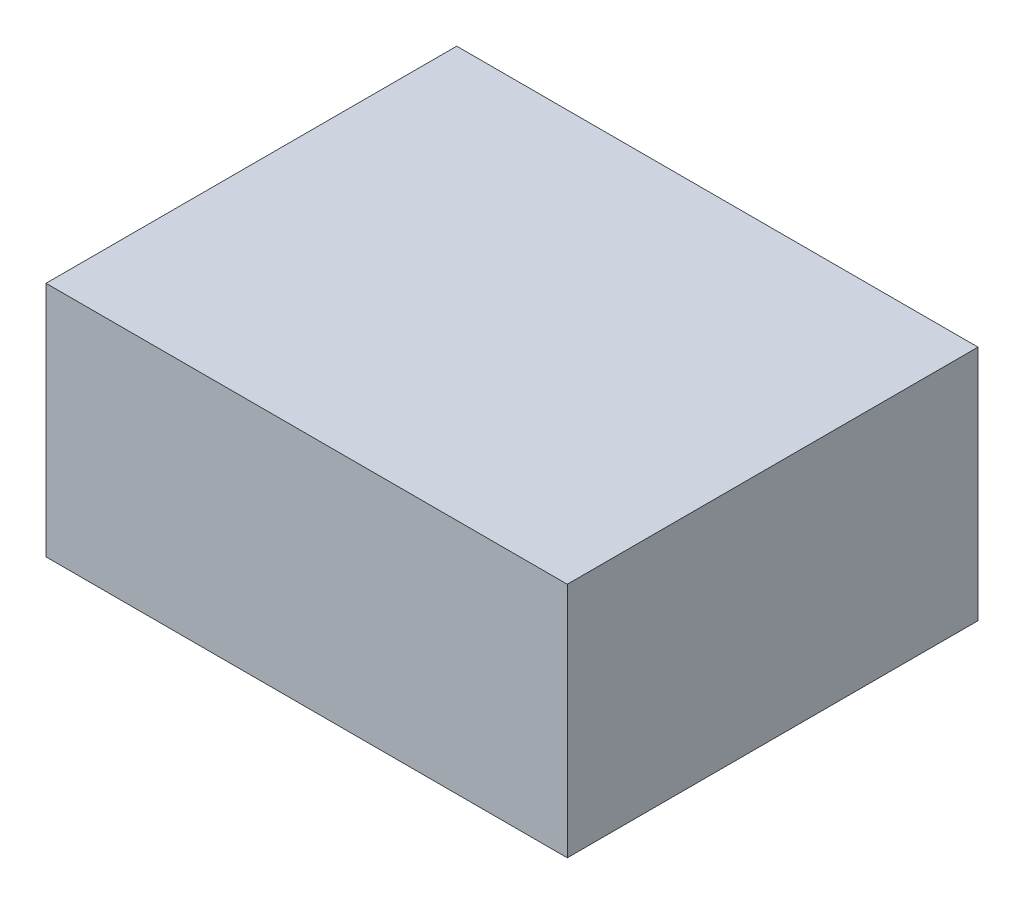
ISO-10303-21;
HEADER;
FILE_DESCRIPTION(('STEP AP214'),'2;1');
FILE_NAME('part.step','',(''),(''),'','','');
FILE_SCHEMA(('AUTOMOTIVE_DESIGN { 1 0 10303 214 1 1 1 1 }'));
ENDSEC;
DATA;
#1=APPLICATION_CONTEXT('core data for automotive mechanical design processes');
#2=APPLICATION_PROTOCOL_DEFINITION('international standard','automotive_design',2000,#1);
#3=PRODUCT_CONTEXT('',#1,'mechanical');
#4=PRODUCT('Part','Part','',(#3));
#5=PRODUCT_RELATED_PRODUCT_CATEGORY('part','',(#4));
#6=PRODUCT_DEFINITION_FORMATION('','',#4);
#7=PRODUCT_DEFINITION_CONTEXT('part definition',#1,'design');
#8=PRODUCT_DEFINITION('design','',#6,#7);
#9=PRODUCT_DEFINITION_SHAPE('','',#8);
#10=(LENGTH_UNIT() NAMED_UNIT(*) SI_UNIT(.MILLI.,.METRE.));
#11=(NAMED_UNIT(*) PLANE_ANGLE_UNIT() SI_UNIT($,.RADIAN.));
#12=(NAMED_UNIT(*) SI_UNIT($,.STERADIAN.) SOLID_ANGLE_UNIT());
#13=UNCERTAINTY_MEASURE_WITH_UNIT(LENGTH_MEASURE(1.E-05),#10,'distance_accuracy_value','');
#14=(GEOMETRIC_REPRESENTATION_CONTEXT(3) GLOBAL_UNCERTAINTY_ASSIGNED_CONTEXT((#13)) GLOBAL_UNIT_ASSIGNED_CONTEXT((#10,
#11,#12)) REPRESENTATION_CONTEXT('',''));
#15=CARTESIAN_POINT('',(0.,0.,0.));
#16=DIRECTION('',(0.,0.,1.));
#17=DIRECTION('',(1.,0.,0.));
#18=AXIS2_PLACEMENT_3D('',#15,#16,#17);
#19=CARTESIAN_POINT('',(-0.16499586,-0.07499857999998,0.));
#20=DIRECTION('',(0.,1.,0.));
#21=DIRECTION('',(1.,0.,0.));
#22=AXIS2_PLACEMENT_3D('',#19,#20,#21);
#23=PLANE('',#22);
#24=DIRECTION('',(1.,0.,0.));
#25=VECTOR('',#24,1.);
#26=CARTESIAN_POINT('',(-0.16499586,-0.07499857999998,0.));
#27=LINE('',#26,#25);
#28=CARTESIAN_POINT('',(-0.16499586,-0.07499857999998,0.));
#29=VERTEX_POINT('',#28);
#30=CARTESIAN_POINT('',(0.1649984,-0.07499857999998,0.));
#31=VERTEX_POINT('',#30);
#32=EDGE_CURVE('E11',#29,#31,#27,.T.);
#33=ORIENTED_EDGE('',*,*,#32,.T.);
#34=DIRECTION('',(0.,0.,1.));
#35=VECTOR('',#34,1.);
#36=CARTESIAN_POINT('',(0.1649984,-0.07499857999998,0.));
#37=LINE('',#36,#35);
#38=CARTESIAN_POINT('',(0.1649984,-0.07499857999998,0.25999948));
#39=VERTEX_POINT('',#38);
#40=EDGE_CURVE('E24',#31,#39,#37,.T.);
#41=ORIENTED_EDGE('',*,*,#40,.T.);
#42=DIRECTION('',(1.,0.,0.));
#43=VECTOR('',#42,1.);
#44=CARTESIAN_POINT('',(-0.16499586,-0.07499857999998,0.25999948));
#45=LINE('',#44,#43);
#46=CARTESIAN_POINT('',(-0.16499586,-0.07499857999998,0.25999948));
#47=VERTEX_POINT('',#46);
#48=EDGE_CURVE('E87',#47,#39,#45,.T.);
#49=ORIENTED_EDGE('',*,*,#48,.F.);
#50=DIRECTION('',(0.,0.,1.));
#51=VECTOR('',#50,1.);
#52=CARTESIAN_POINT('',(-0.16499586,-0.07499857999998,0.));
#53=LINE('',#52,#51);
#54=EDGE_CURVE('E36',#29,#47,#53,.T.);
#55=ORIENTED_EDGE('',*,*,#54,.F.);
#56=EDGE_LOOP('',(#33,#41,#49,#55));
#57=FACE_BOUND('',#56,.T.);
#58=ADVANCED_FACE('F17',(#57),#23,.F.);
#59=CARTESIAN_POINT('',(0.1649984,-0.07499857999998,0.));
#60=DIRECTION('',(-0.999999999856631,1.69333673670937E-05,0.));
#61=DIRECTION('',(1.69333673670937E-05,0.999999999856631,0.));
#62=AXIS2_PLACEMENT_3D('',#59,#60,#61);
#63=PLANE('',#62);
#64=DIRECTION('',(1.69333673670937E-05,0.999999999856631,0.));
#65=VECTOR('',#64,1.);
#66=CARTESIAN_POINT('',(0.1649984,-0.07499857999998,0.));
#67=LINE('',#66,#65);
#68=CARTESIAN_POINT('',(0.16500094,0.07500112000001,0.));
#69=VERTEX_POINT('',#68);
#70=EDGE_CURVE('E84',#31,#69,#67,.T.);
#71=ORIENTED_EDGE('',*,*,#70,.T.);
#72=DIRECTION('',(0.,0.,1.));
#73=VECTOR('',#72,1.);
#74=CARTESIAN_POINT('',(0.16500094,0.07500112000001,0.));
#75=LINE('',#74,#73);
#76=CARTESIAN_POINT('',(0.16500094,0.07500112000001,0.25999948));
#77=VERTEX_POINT('',#76);
#78=EDGE_CURVE('E82',#69,#77,#75,.T.);
#79=ORIENTED_EDGE('',*,*,#78,.T.);
#80=DIRECTION('',(1.69333673670937E-05,0.999999999856631,0.));
#81=VECTOR('',#80,1.);
#82=CARTESIAN_POINT('',(0.1649984,-0.07499857999998,0.25999948));
#83=LINE('',#82,#81);
#84=EDGE_CURVE('E62',#39,#77,#83,.T.);
#85=ORIENTED_EDGE('',*,*,#84,.F.);
#86=ORIENTED_EDGE('',*,*,#40,.F.);
#87=EDGE_LOOP('',(#71,#79,#85,#86));
#88=FACE_BOUND('',#87,.T.);
#89=ADVANCED_FACE('F89',(#88),#63,.F.);
#90=CARTESIAN_POINT('',(0.16500094,0.07500112000001,0.));
#91=DIRECTION('',(0.,-1.,0.));
#92=DIRECTION('',(-1.,0.,0.));
#93=AXIS2_PLACEMENT_3D('',#90,#91,#92);
#94=PLANE('',#93);
#95=DIRECTION('',(-1.,0.,0.));
#96=VECTOR('',#95,1.);
#97=CARTESIAN_POINT('',(0.16500094,0.07500112000001,0.));
#98=LINE('',#97,#96);
#99=CARTESIAN_POINT('',(-0.1649984,0.07500112000001,0.));
#100=VERTEX_POINT('',#99);
#101=EDGE_CURVE('E71',#69,#100,#98,.T.);
#102=ORIENTED_EDGE('',*,*,#101,.T.);
#103=DIRECTION('',(0.,0.,1.));
#104=VECTOR('',#103,1.);
#105=CARTESIAN_POINT('',(-0.1649984,0.07500112000001,0.));
#106=LINE('',#105,#104);
#107=CARTESIAN_POINT('',(-0.1649984,0.07500112000001,0.25999948));
#108=VERTEX_POINT('',#107);
#109=EDGE_CURVE('E65',#100,#108,#106,.T.);
#110=ORIENTED_EDGE('',*,*,#109,.T.);
#111=DIRECTION('',(-1.,0.,0.));
#112=VECTOR('',#111,1.);
#113=CARTESIAN_POINT('',(0.16500094,0.07500112000001,0.25999948));
#114=LINE('',#113,#112);
#115=EDGE_CURVE('E57',#77,#108,#114,.T.);
#116=ORIENTED_EDGE('',*,*,#115,.F.);
#117=ORIENTED_EDGE('',*,*,#78,.F.);
#118=EDGE_LOOP('',(#102,#110,#116,#117));
#119=FACE_BOUND('',#118,.T.);
#120=ADVANCED_FACE('F69',(#119),#94,.F.);
#121=CARTESIAN_POINT('',(-0.1649984,0.07500112000001,0.));
#122=DIRECTION('',(0.999999999856631,1.69333670828837E-05,0.));
#123=DIRECTION('',(1.69333670828837E-05,-0.999999999856631,0.));
#124=AXIS2_PLACEMENT_3D('',#121,#122,#123);
#125=PLANE('',#124);
#126=DIRECTION('',(1.69333670828837E-05,-0.999999999856631,0.));
#127=VECTOR('',#126,1.);
#128=CARTESIAN_POINT('',(-0.1649984,0.07500112000001,0.));
#129=LINE('',#128,#127);
#130=EDGE_CURVE('E66',#100,#29,#129,.T.);
#131=ORIENTED_EDGE('',*,*,#130,.T.);
#132=ORIENTED_EDGE('',*,*,#54,.T.);
#133=DIRECTION('',(1.69333670828837E-05,-0.999999999856631,0.));
#134=VECTOR('',#133,1.);
#135=CARTESIAN_POINT('',(-0.1649984,0.07500112000001,0.25999948));
#136=LINE('',#135,#134);
#137=EDGE_CURVE('E61',#108,#47,#136,.T.);
#138=ORIENTED_EDGE('',*,*,#137,.F.);
#139=ORIENTED_EDGE('',*,*,#109,.F.);
#140=EDGE_LOOP('',(#131,#132,#138,#139));
#141=FACE_BOUND('',#140,.T.);
#142=ADVANCED_FACE('F76',(#141),#125,.F.);
#143=CARTESIAN_POINT('',(1.27000000205E-06,1.666877113479E-06,0.));
#144=DIRECTION('',(0.,0.,1.));
#145=DIRECTION('',(1.,0.,0.));
#146=AXIS2_PLACEMENT_3D('',#143,#144,#145);
#147=PLANE('',#146);
#148=ORIENTED_EDGE('',*,*,#130,.F.);
#149=ORIENTED_EDGE('',*,*,#101,.F.);
#150=ORIENTED_EDGE('',*,*,#70,.F.);
#151=ORIENTED_EDGE('',*,*,#32,.F.);
#152=EDGE_LOOP('',(#148,#149,#150,#151));
#153=FACE_BOUND('',#152,.T.);
#154=ADVANCED_FACE('F91',(#153),#147,.F.);
#155=CARTESIAN_POINT('',(1.27000000205E-06,1.666877113479E-06,0.25999948));
#156=DIRECTION('',(0.,0.,1.));
#157=DIRECTION('',(1.,0.,0.));
#158=AXIS2_PLACEMENT_3D('',#155,#156,#157);
#159=PLANE('',#158);
#160=ORIENTED_EDGE('',*,*,#48,.T.);
#161=ORIENTED_EDGE('',*,*,#84,.T.);
#162=ORIENTED_EDGE('',*,*,#115,.T.);
#163=ORIENTED_EDGE('',*,*,#137,.T.);
#164=EDGE_LOOP('',(#160,#161,#162,#163));
#165=FACE_BOUND('',#164,.T.);
#166=ADVANCED_FACE('F59',(#165),#159,.T.);
#167=CLOSED_SHELL('',(#58,#89,#120,#142,#154,#166));
#168=MANIFOLD_SOLID_BREP('B1',#167);
#169=ADVANCED_BREP_SHAPE_REPRESENTATION('',(#18,#168),#14);
#170=SHAPE_DEFINITION_REPRESENTATION(#9,#169);
ENDSEC;
END-ISO-10303-21;
